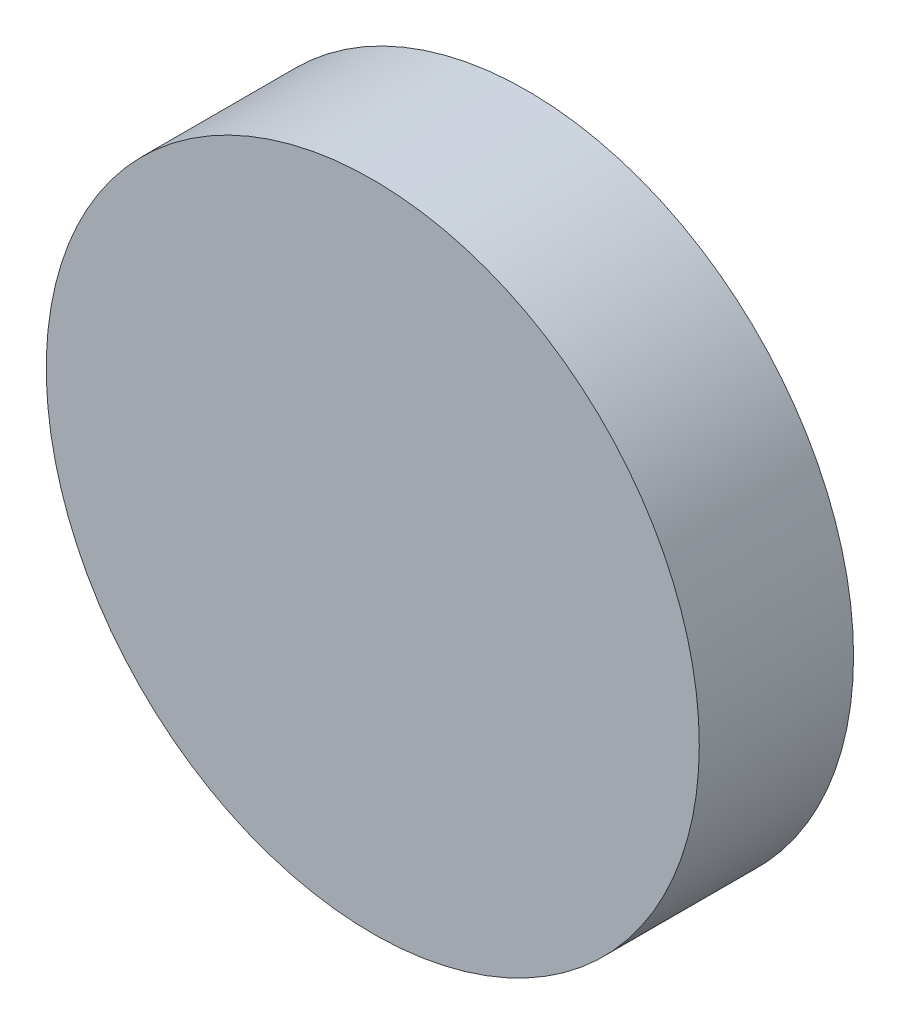
ISO-10303-21;
HEADER;
FILE_DESCRIPTION(('STEP AP214'),'2;1');
FILE_NAME('part.step','',(''),(''),'','','');
FILE_SCHEMA(('AUTOMOTIVE_DESIGN { 1 0 10303 214 1 1 1 1 }'));
ENDSEC;
DATA;
#1=APPLICATION_CONTEXT('core data for automotive mechanical design processes');
#2=APPLICATION_PROTOCOL_DEFINITION('international standard','automotive_design',2000,#1);
#3=PRODUCT_CONTEXT('',#1,'mechanical');
#4=PRODUCT('Part','Part','',(#3));
#5=PRODUCT_RELATED_PRODUCT_CATEGORY('part','',(#4));
#6=PRODUCT_DEFINITION_FORMATION('','',#4);
#7=PRODUCT_DEFINITION_CONTEXT('part definition',#1,'design');
#8=PRODUCT_DEFINITION('design','',#6,#7);
#9=PRODUCT_DEFINITION_SHAPE('','',#8);
#10=(LENGTH_UNIT() NAMED_UNIT(*) SI_UNIT(.MILLI.,.METRE.));
#11=(NAMED_UNIT(*) PLANE_ANGLE_UNIT() SI_UNIT($,.RADIAN.));
#12=(NAMED_UNIT(*) SI_UNIT($,.STERADIAN.) SOLID_ANGLE_UNIT());
#13=UNCERTAINTY_MEASURE_WITH_UNIT(LENGTH_MEASURE(1.E-05),#10,'distance_accuracy_value','');
#14=(GEOMETRIC_REPRESENTATION_CONTEXT(3) GLOBAL_UNCERTAINTY_ASSIGNED_CONTEXT((#13)) GLOBAL_UNIT_ASSIGNED_CONTEXT((#10,
#11,#12)) REPRESENTATION_CONTEXT('',''));
#15=CARTESIAN_POINT('',(0.,0.,0.));
#16=DIRECTION('',(0.,0.,1.));
#17=DIRECTION('',(1.,0.,0.));
#18=AXIS2_PLACEMENT_3D('',#15,#16,#17);
#19=CARTESIAN_POINT('',(0.,0.,6.));
#20=DIRECTION('',(0.,0.,-1.));
#21=DIRECTION('',(-1.,0.,0.));
#22=AXIS2_PLACEMENT_3D('',#19,#20,#21);
#23=CYLINDRICAL_SURFACE('',#22,12.7);
#24=CARTESIAN_POINT('',(0.,0.,6.));
#25=DIRECTION('',(0.,0.,1.));
#26=DIRECTION('',(1.,0.,0.));
#27=AXIS2_PLACEMENT_3D('',#24,#25,#26);
#28=CIRCLE('',#27,12.7);
#29=CARTESIAN_POINT('',(12.7,0.,6.));
#30=VERTEX_POINT('',#29);
#31=EDGE_CURVE('E10',#30,#30,#28,.T.);
#32=ORIENTED_EDGE('',*,*,#31,.F.);
#33=EDGE_LOOP('',(#32));
#34=FACE_BOUND('',#33,.T.);
#35=CARTESIAN_POINT('',(0.,0.,0.));
#36=DIRECTION('',(0.,0.,1.));
#37=DIRECTION('',(1.,0.,0.));
#38=AXIS2_PLACEMENT_3D('',#35,#36,#37);
#39=CIRCLE('',#38,12.7);
#40=CARTESIAN_POINT('',(12.7,0.,0.));
#41=VERTEX_POINT('',#40);
#42=EDGE_CURVE('E38',#41,#41,#39,.T.);
#43=ORIENTED_EDGE('',*,*,#42,.T.);
#44=EDGE_LOOP('',(#43));
#45=FACE_BOUND('',#44,.T.);
#46=ADVANCED_FACE('F35',(#34,#45),#23,.T.);
#47=CARTESIAN_POINT('',(0.,0.,6.));
#48=DIRECTION('',(0.,0.,1.));
#49=DIRECTION('',(1.,0.,0.));
#50=AXIS2_PLACEMENT_3D('',#47,#48,#49);
#51=PLANE('',#50);
#52=ORIENTED_EDGE('',*,*,#31,.T.);
#53=EDGE_LOOP('',(#52));
#54=FACE_BOUND('',#53,.T.);
#55=ADVANCED_FACE('F50',(#54),#51,.T.);
#56=CARTESIAN_POINT('',(0.,0.,0.));
#57=DIRECTION('',(0.,0.,1.));
#58=DIRECTION('',(1.,0.,0.));
#59=AXIS2_PLACEMENT_3D('',#56,#57,#58);
#60=PLANE('',#59);
#61=ORIENTED_EDGE('',*,*,#42,.F.);
#62=EDGE_LOOP('',(#61));
#63=FACE_BOUND('',#62,.T.);
#64=ADVANCED_FACE('F48',(#63),#60,.F.);
#65=CLOSED_SHELL('',(#46,#55,#64));
#66=MANIFOLD_SOLID_BREP('B2',#65);
#67=ADVANCED_BREP_SHAPE_REPRESENTATION('',(#18,#66),#14);
#68=SHAPE_DEFINITION_REPRESENTATION(#9,#67);
ENDSEC;
END-ISO-10303-21;
